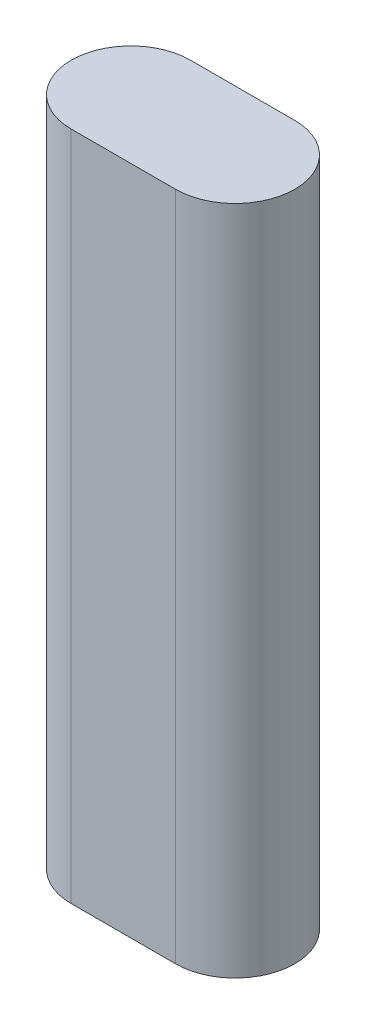
ISO-10303-21;
HEADER;
FILE_DESCRIPTION(('STEP AP214'),'2;1');
FILE_NAME('part.step','',(''),(''),'','','');
FILE_SCHEMA(('AUTOMOTIVE_DESIGN { 1 0 10303 214 1 1 1 1 }'));
ENDSEC;
DATA;
#1=APPLICATION_CONTEXT('core data for automotive mechanical design processes');
#2=APPLICATION_PROTOCOL_DEFINITION('international standard','automotive_design',2000,#1);
#3=PRODUCT_CONTEXT('',#1,'mechanical');
#4=PRODUCT('Part','Part','',(#3));
#5=PRODUCT_RELATED_PRODUCT_CATEGORY('part','',(#4));
#6=PRODUCT_DEFINITION_FORMATION('','',#4);
#7=PRODUCT_DEFINITION_CONTEXT('part definition',#1,'design');
#8=PRODUCT_DEFINITION('design','',#6,#7);
#9=PRODUCT_DEFINITION_SHAPE('','',#8);
#10=(LENGTH_UNIT() NAMED_UNIT(*) SI_UNIT(.MILLI.,.METRE.));
#11=(NAMED_UNIT(*) PLANE_ANGLE_UNIT() SI_UNIT($,.RADIAN.));
#12=(NAMED_UNIT(*) SI_UNIT($,.STERADIAN.) SOLID_ANGLE_UNIT());
#13=UNCERTAINTY_MEASURE_WITH_UNIT(LENGTH_MEASURE(1.E-05),#10,'distance_accuracy_value','');
#14=(GEOMETRIC_REPRESENTATION_CONTEXT(3) GLOBAL_UNCERTAINTY_ASSIGNED_CONTEXT((#13)) GLOBAL_UNIT_ASSIGNED_CONTEXT((#10,
#11,#12)) REPRESENTATION_CONTEXT('',''));
#15=CARTESIAN_POINT('',(0.,0.,0.));
#16=DIRECTION('',(0.,0.,1.));
#17=DIRECTION('',(1.,0.,0.));
#18=AXIS2_PLACEMENT_3D('',#15,#16,#17);
#19=CARTESIAN_POINT('',(-10.5,135.,0.));
#20=DIRECTION('',(0.,-1.,0.));
#21=DIRECTION('',(0.,0.,-1.));
#22=AXIS2_PLACEMENT_3D('',#19,#20,#21);
#23=CYLINDRICAL_SURFACE('',#22,12.);
#24=CARTESIAN_POINT('',(-10.5,0.,0.));
#25=DIRECTION('',(0.,1.,0.));
#26=DIRECTION('',(0.,0.,1.));
#27=AXIS2_PLACEMENT_3D('',#24,#25,#26);
#28=CIRCLE('',#27,12.);
#29=CARTESIAN_POINT('',(-10.5,0.,-12.));
#30=VERTEX_POINT('',#29);
#31=CARTESIAN_POINT('',(-10.5,0.,12.));
#32=VERTEX_POINT('',#31);
#33=EDGE_CURVE('E96',#30,#32,#28,.T.);
#34=ORIENTED_EDGE('',*,*,#33,.T.);
#35=DIRECTION('',(0.,-1.,0.));
#36=VECTOR('',#35,1.);
#37=CARTESIAN_POINT('',(-10.5,135.,12.));
#38=LINE('',#37,#36);
#39=CARTESIAN_POINT('',(-10.5,135.,12.));
#40=VERTEX_POINT('',#39);
#41=EDGE_CURVE('E11',#40,#32,#38,.T.);
#42=ORIENTED_EDGE('',*,*,#41,.F.);
#43=CARTESIAN_POINT('',(-10.5,135.,0.));
#44=DIRECTION('',(0.,1.,0.));
#45=DIRECTION('',(0.,0.,1.));
#46=AXIS2_PLACEMENT_3D('',#43,#44,#45);
#47=CIRCLE('',#46,12.);
#48=CARTESIAN_POINT('',(-10.5,135.,-12.));
#49=VERTEX_POINT('',#48);
#50=EDGE_CURVE('E84',#49,#40,#47,.T.);
#51=ORIENTED_EDGE('',*,*,#50,.F.);
#52=DIRECTION('',(0.,-1.,0.));
#53=VECTOR('',#52,1.);
#54=CARTESIAN_POINT('',(-10.5,135.,-12.));
#55=LINE('',#54,#53);
#56=EDGE_CURVE('E92',#49,#30,#55,.T.);
#57=ORIENTED_EDGE('',*,*,#56,.T.);
#58=EDGE_LOOP('',(#34,#42,#51,#57));
#59=FACE_BOUND('',#58,.T.);
#60=ADVANCED_FACE('F33',(#59),#23,.T.);
#61=CARTESIAN_POINT('',(-10.5,135.,12.));
#62=DIRECTION('',(0.,0.,-1.));
#63=DIRECTION('',(-1.,0.,0.));
#64=AXIS2_PLACEMENT_3D('',#61,#62,#63);
#65=PLANE('',#64);
#66=DIRECTION('',(1.,0.,0.));
#67=VECTOR('',#66,1.);
#68=CARTESIAN_POINT('',(-10.5,0.,12.));
#69=LINE('',#68,#67);
#70=CARTESIAN_POINT('',(10.5,0.,12.));
#71=VERTEX_POINT('',#70);
#72=EDGE_CURVE('E88',#32,#71,#69,.T.);
#73=ORIENTED_EDGE('',*,*,#72,.T.);
#74=DIRECTION('',(0.,-1.,0.));
#75=VECTOR('',#74,1.);
#76=CARTESIAN_POINT('',(10.5,135.,12.));
#77=LINE('',#76,#75);
#78=CARTESIAN_POINT('',(10.5,135.,12.));
#79=VERTEX_POINT('',#78);
#80=EDGE_CURVE('E41',#79,#71,#77,.T.);
#81=ORIENTED_EDGE('',*,*,#80,.F.);
#82=DIRECTION('',(1.,0.,0.));
#83=VECTOR('',#82,1.);
#84=CARTESIAN_POINT('',(-10.5,135.,12.));
#85=LINE('',#84,#83);
#86=EDGE_CURVE('E79',#40,#79,#85,.T.);
#87=ORIENTED_EDGE('',*,*,#86,.F.);
#88=ORIENTED_EDGE('',*,*,#41,.T.);
#89=EDGE_LOOP('',(#73,#81,#87,#88));
#90=FACE_BOUND('',#89,.T.);
#91=ADVANCED_FACE('F87',(#90),#65,.F.);
#92=CARTESIAN_POINT('',(10.5,135.,0.));
#93=DIRECTION('',(0.,-1.,0.));
#94=DIRECTION('',(0.,0.,-1.));
#95=AXIS2_PLACEMENT_3D('',#92,#93,#94);
#96=CYLINDRICAL_SURFACE('',#95,12.);
#97=CARTESIAN_POINT('',(10.5,0.,0.));
#98=DIRECTION('',(0.,1.,0.));
#99=DIRECTION('',(0.,0.,1.));
#100=AXIS2_PLACEMENT_3D('',#97,#98,#99);
#101=CIRCLE('',#100,12.);
#102=CARTESIAN_POINT('',(10.5,0.,-12.));
#103=VERTEX_POINT('',#102);
#104=EDGE_CURVE('E66',#71,#103,#101,.T.);
#105=ORIENTED_EDGE('',*,*,#104,.T.);
#106=DIRECTION('',(0.,-1.,0.));
#107=VECTOR('',#106,1.);
#108=CARTESIAN_POINT('',(10.5,135.,-12.));
#109=LINE('',#108,#107);
#110=CARTESIAN_POINT('',(10.5,135.,-12.));
#111=VERTEX_POINT('',#110);
#112=EDGE_CURVE('E89',#111,#103,#109,.T.);
#113=ORIENTED_EDGE('',*,*,#112,.F.);
#114=CARTESIAN_POINT('',(10.5,135.,0.));
#115=DIRECTION('',(0.,1.,0.));
#116=DIRECTION('',(0.,0.,1.));
#117=AXIS2_PLACEMENT_3D('',#114,#115,#116);
#118=CIRCLE('',#117,12.);
#119=EDGE_CURVE('E82',#79,#111,#118,.T.);
#120=ORIENTED_EDGE('',*,*,#119,.F.);
#121=ORIENTED_EDGE('',*,*,#80,.T.);
#122=EDGE_LOOP('',(#105,#113,#120,#121));
#123=FACE_BOUND('',#122,.T.);
#124=ADVANCED_FACE('F90',(#123),#96,.T.);
#125=CARTESIAN_POINT('',(-10.5,135.,-12.));
#126=DIRECTION('',(0.,0.,1.));
#127=DIRECTION('',(1.,0.,0.));
#128=AXIS2_PLACEMENT_3D('',#125,#126,#127);
#129=PLANE('',#128);
#130=DIRECTION('',(-1.,0.,0.));
#131=VECTOR('',#130,1.);
#132=CARTESIAN_POINT('',(-10.5,0.,-12.));
#133=LINE('',#132,#131);
#134=EDGE_CURVE('E72',#103,#30,#133,.T.);
#135=ORIENTED_EDGE('',*,*,#134,.T.);
#136=ORIENTED_EDGE('',*,*,#56,.F.);
#137=DIRECTION('',(-1.,0.,0.));
#138=VECTOR('',#137,1.);
#139=CARTESIAN_POINT('',(-10.5,135.,-12.));
#140=LINE('',#139,#138);
#141=EDGE_CURVE('E49',#111,#49,#140,.T.);
#142=ORIENTED_EDGE('',*,*,#141,.F.);
#143=ORIENTED_EDGE('',*,*,#112,.T.);
#144=EDGE_LOOP('',(#135,#136,#142,#143));
#145=FACE_BOUND('',#144,.T.);
#146=ADVANCED_FACE('F103',(#145),#129,.F.);
#147=CARTESIAN_POINT('',(-10.5,135.,0.));
#148=DIRECTION('',(0.,1.,0.));
#149=DIRECTION('',(0.,0.,1.));
#150=AXIS2_PLACEMENT_3D('',#147,#148,#149);
#151=PLANE('',#150);
#152=ORIENTED_EDGE('',*,*,#50,.T.);
#153=ORIENTED_EDGE('',*,*,#86,.T.);
#154=ORIENTED_EDGE('',*,*,#119,.T.);
#155=ORIENTED_EDGE('',*,*,#141,.T.);
#156=EDGE_LOOP('',(#152,#153,#154,#155));
#157=FACE_BOUND('',#156,.T.);
#158=ADVANCED_FACE('F80',(#157),#151,.T.);
#159=CARTESIAN_POINT('',(-10.5,0.,0.));
#160=DIRECTION('',(0.,1.,0.));
#161=DIRECTION('',(0.,0.,1.));
#162=AXIS2_PLACEMENT_3D('',#159,#160,#161);
#163=PLANE('',#162);
#164=ORIENTED_EDGE('',*,*,#33,.F.);
#165=ORIENTED_EDGE('',*,*,#134,.F.);
#166=ORIENTED_EDGE('',*,*,#104,.F.);
#167=ORIENTED_EDGE('',*,*,#72,.F.);
#168=EDGE_LOOP('',(#164,#165,#166,#167));
#169=FACE_BOUND('',#168,.T.);
#170=ADVANCED_FACE('F106',(#169),#163,.F.);
#171=CLOSED_SHELL('',(#60,#91,#124,#146,#158,#170));
#172=MANIFOLD_SOLID_BREP('B2',#171);
#173=ADVANCED_BREP_SHAPE_REPRESENTATION('',(#18,#172),#14);
#174=SHAPE_DEFINITION_REPRESENTATION(#9,#173);
ENDSEC;
END-ISO-10303-21;
